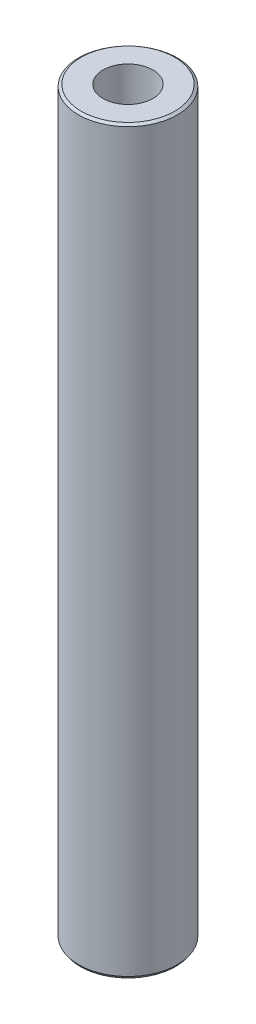
ISO-10303-21;
HEADER;
FILE_DESCRIPTION(('STEP AP214'),'2;1');
FILE_NAME('part.step','',(''),(''),'','','');
FILE_SCHEMA(('AUTOMOTIVE_DESIGN { 1 0 10303 214 1 1 1 1 }'));
ENDSEC;
DATA;
#1=APPLICATION_CONTEXT('core data for automotive mechanical design processes');
#2=APPLICATION_PROTOCOL_DEFINITION('international standard','automotive_design',2000,#1);
#3=PRODUCT_CONTEXT('',#1,'mechanical');
#4=PRODUCT('Part','Part','',(#3));
#5=PRODUCT_RELATED_PRODUCT_CATEGORY('part','',(#4));
#6=PRODUCT_DEFINITION_FORMATION('','',#4);
#7=PRODUCT_DEFINITION_CONTEXT('part definition',#1,'design');
#8=PRODUCT_DEFINITION('design','',#6,#7);
#9=PRODUCT_DEFINITION_SHAPE('','',#8);
#10=(LENGTH_UNIT() NAMED_UNIT(*) SI_UNIT(.MILLI.,.METRE.));
#11=(NAMED_UNIT(*) PLANE_ANGLE_UNIT() SI_UNIT($,.RADIAN.));
#12=(NAMED_UNIT(*) SI_UNIT($,.STERADIAN.) SOLID_ANGLE_UNIT());
#13=UNCERTAINTY_MEASURE_WITH_UNIT(LENGTH_MEASURE(1.E-05),#10,'distance_accuracy_value','');
#14=(GEOMETRIC_REPRESENTATION_CONTEXT(3) GLOBAL_UNCERTAINTY_ASSIGNED_CONTEXT((#13)) GLOBAL_UNIT_ASSIGNED_CONTEXT((#10,
#11,#12)) REPRESENTATION_CONTEXT('',''));
#15=CARTESIAN_POINT('',(0.,0.,0.));
#16=DIRECTION('',(0.,0.,1.));
#17=DIRECTION('',(1.,0.,0.));
#18=AXIS2_PLACEMENT_3D('',#15,#16,#17);
#19=CARTESIAN_POINT('',(0.,486.896096195802,0.));
#20=DIRECTION('',(0.,-1.,0.));
#21=DIRECTION('',(0.,0.,-1.));
#22=AXIS2_PLACEMENT_3D('',#19,#20,#21);
#23=CYLINDRICAL_SURFACE('',#22,32.5);
#24=CARTESIAN_POINT('',(0.,485.682254095512,0.));
#25=DIRECTION('',(0.,1.,0.));
#26=DIRECTION('',(0.,0.,1.));
#27=AXIS2_PLACEMENT_3D('',#24,#25,#26);
#28=CIRCLE('',#27,32.5);
#29=CARTESIAN_POINT('',(0.,485.682254095512,32.5));
#30=VERTEX_POINT('',#29);
#31=EDGE_CURVE('E50',#30,#30,#28,.F.);
#32=ORIENTED_EDGE('',*,*,#31,.T.);
#33=EDGE_LOOP('',(#32));
#34=FACE_BOUND('',#33,.T.);
#35=CARTESIAN_POINT('',(0.,1.72790639572412,0.));
#36=DIRECTION('',(0.,1.,0.));
#37=DIRECTION('',(0.,0.,1.));
#38=AXIS2_PLACEMENT_3D('',#35,#36,#37);
#39=CIRCLE('',#38,32.5);
#40=CARTESIAN_POINT('',(0.,1.72790639572412,32.5));
#41=VERTEX_POINT('',#40);
#42=EDGE_CURVE('E51',#41,#41,#39,.T.);
#43=ORIENTED_EDGE('',*,*,#42,.T.);
#44=EDGE_LOOP('',(#43));
#45=FACE_BOUND('',#44,.T.);
#46=ADVANCED_FACE('F39',(#34,#45),#23,.T.);
#47=CARTESIAN_POINT('',(0.,486.896096195802,0.));
#48=DIRECTION('',(0.,1.,0.));
#49=DIRECTION('',(0.,0.,1.));
#50=AXIS2_PLACEMENT_3D('',#47,#48,#49);
#51=PLANE('',#50);
#52=CARTESIAN_POINT('',(0.,486.896096195802,0.));
#53=DIRECTION('',(0.,1.,0.));
#54=DIRECTION('',(0.,0.,1.));
#55=AXIS2_PLACEMENT_3D('',#52,#53,#54);
#56=CIRCLE('',#55,30.772093604276);
#57=CARTESIAN_POINT('',(0.,486.896096195802,30.772093604276));
#58=VERTEX_POINT('',#57);
#59=EDGE_CURVE('E54',#58,#58,#56,.T.);
#60=ORIENTED_EDGE('',*,*,#59,.T.);
#61=EDGE_LOOP('',(#60));
#62=FACE_BOUND('',#61,.T.);
#63=CARTESIAN_POINT('',(0.,486.896096195802,0.));
#64=DIRECTION('',(0.,1.,0.));
#65=DIRECTION('',(0.,0.,1.));
#66=AXIS2_PLACEMENT_3D('',#63,#64,#65);
#67=CIRCLE('',#66,16.3550196881989);
#68=CARTESIAN_POINT('',(0.,486.896096195802,16.3550196881989));
#69=VERTEX_POINT('',#68);
#70=EDGE_CURVE('E58',#69,#69,#67,.T.);
#71=ORIENTED_EDGE('',*,*,#70,.F.);
#72=EDGE_LOOP('',(#71));
#73=FACE_BOUND('',#72,.T.);
#74=ADVANCED_FACE('F69',(#62,#73),#51,.T.);
#75=CARTESIAN_POINT('',(0.,0.,0.));
#76=DIRECTION('',(0.,1.,0.));
#77=DIRECTION('',(0.,0.,1.));
#78=AXIS2_PLACEMENT_3D('',#75,#76,#77);
#79=PLANE('',#78);
#80=CARTESIAN_POINT('',(0.,0.,0.));
#81=DIRECTION('',(0.,1.,0.));
#82=DIRECTION('',(0.,0.,1.));
#83=AXIS2_PLACEMENT_3D('',#80,#81,#82);
#84=CIRCLE('',#83,31.2861578997095);
#85=CARTESIAN_POINT('',(0.,0.,31.2861578997095));
#86=VERTEX_POINT('',#85);
#87=EDGE_CURVE('E10',#86,#86,#84,.F.);
#88=ORIENTED_EDGE('',*,*,#87,.T.);
#89=EDGE_LOOP('',(#88));
#90=FACE_BOUND('',#89,.T.);
#91=CARTESIAN_POINT('',(0.,0.,0.));
#92=DIRECTION('',(0.,1.,0.));
#93=DIRECTION('',(0.,0.,1.));
#94=AXIS2_PLACEMENT_3D('',#91,#92,#93);
#95=CIRCLE('',#94,16.3550196881989);
#96=CARTESIAN_POINT('',(0.,0.,16.3550196881989));
#97=VERTEX_POINT('',#96);
#98=EDGE_CURVE('E63',#97,#97,#95,.T.);
#99=ORIENTED_EDGE('',*,*,#98,.T.);
#100=EDGE_LOOP('',(#99));
#101=FACE_BOUND('',#100,.T.);
#102=ADVANCED_FACE('F75',(#90,#101),#79,.F.);
#103=CARTESIAN_POINT('',(0.,486.896096195802,0.));
#104=DIRECTION('',(0.,-1.,0.));
#105=DIRECTION('',(0.,0.,-1.));
#106=AXIS2_PLACEMENT_3D('',#103,#104,#105);
#107=CYLINDRICAL_SURFACE('',#106,16.3550196881989);
#108=ORIENTED_EDGE('',*,*,#70,.T.);
#109=EDGE_LOOP('',(#108));
#110=FACE_BOUND('',#109,.T.);
#111=ORIENTED_EDGE('',*,*,#98,.F.);
#112=EDGE_LOOP('',(#111));
#113=FACE_BOUND('',#112,.T.);
#114=ADVANCED_FACE('F70',(#110,#113),#107,.F.);
#115=CARTESIAN_POINT('',(0.,486.896096195802,0.));
#116=DIRECTION('',(0.,-1.,0.));
#117=DIRECTION('',(0.,0.,-1.));
#118=AXIS2_PLACEMENT_3D('',#115,#116,#117);
#119=CONICAL_SURFACE('',#118,30.772093604276,0.958399185271034);
#120=ORIENTED_EDGE('',*,*,#31,.F.);
#121=EDGE_LOOP('',(#120));
#122=FACE_BOUND('',#121,.T.);
#123=ORIENTED_EDGE('',*,*,#59,.F.);
#124=EDGE_LOOP('',(#123));
#125=FACE_BOUND('',#124,.T.);
#126=ADVANCED_FACE('F81',(#122,#125),#119,.T.);
#127=CARTESIAN_POINT('',(0.,1.72790639572412,0.));
#128=DIRECTION('',(0.,1.,0.));
#129=DIRECTION('',(0.,0.,1.));
#130=AXIS2_PLACEMENT_3D('',#127,#128,#129);
#131=CONICAL_SURFACE('',#130,32.5,0.612397141523857);
#132=ORIENTED_EDGE('',*,*,#87,.F.);
#133=EDGE_LOOP('',(#132));
#134=FACE_BOUND('',#133,.T.);
#135=ORIENTED_EDGE('',*,*,#42,.F.);
#136=EDGE_LOOP('',(#135));
#137=FACE_BOUND('',#136,.T.);
#138=ADVANCED_FACE('F45',(#134,#137),#131,.T.);
#139=CLOSED_SHELL('',(#46,#74,#102,#114,#126,#138));
#140=MANIFOLD_SOLID_BREP('B2',#139);
#141=ADVANCED_BREP_SHAPE_REPRESENTATION('',(#18,#140),#14);
#142=SHAPE_DEFINITION_REPRESENTATION(#9,#141);
ENDSEC;
END-ISO-10303-21;
